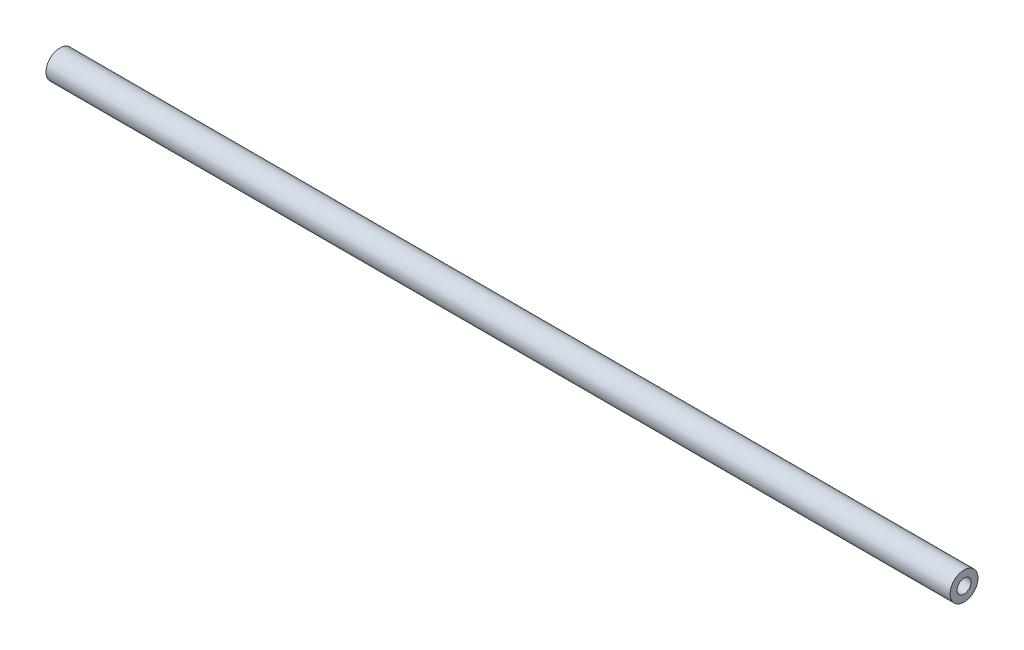
ISO-10303-21;
HEADER;
FILE_DESCRIPTION(('STEP AP214'),'2;1');
FILE_NAME('part.step','',(''),(''),'','','');
FILE_SCHEMA(('AUTOMOTIVE_DESIGN { 1 0 10303 214 1 1 1 1 }'));
ENDSEC;
DATA;
#1=APPLICATION_CONTEXT('core data for automotive mechanical design processes');
#2=APPLICATION_PROTOCOL_DEFINITION('international standard','automotive_design',2000,#1);
#3=PRODUCT_CONTEXT('',#1,'mechanical');
#4=PRODUCT('Part','Part','',(#3));
#5=PRODUCT_RELATED_PRODUCT_CATEGORY('part','',(#4));
#6=PRODUCT_DEFINITION_FORMATION('','',#4);
#7=PRODUCT_DEFINITION_CONTEXT('part definition',#1,'design');
#8=PRODUCT_DEFINITION('design','',#6,#7);
#9=PRODUCT_DEFINITION_SHAPE('','',#8);
#10=(LENGTH_UNIT() NAMED_UNIT(*) SI_UNIT(.MILLI.,.METRE.));
#11=(NAMED_UNIT(*) PLANE_ANGLE_UNIT() SI_UNIT($,.RADIAN.));
#12=(NAMED_UNIT(*) SI_UNIT($,.STERADIAN.) SOLID_ANGLE_UNIT());
#13=UNCERTAINTY_MEASURE_WITH_UNIT(LENGTH_MEASURE(1.E-05),#10,'distance_accuracy_value','');
#14=(GEOMETRIC_REPRESENTATION_CONTEXT(3) GLOBAL_UNCERTAINTY_ASSIGNED_CONTEXT((#13)) GLOBAL_UNIT_ASSIGNED_CONTEXT((#10,
#11,#12)) REPRESENTATION_CONTEXT('',''));
#15=CARTESIAN_POINT('',(0.,0.,0.));
#16=DIRECTION('',(0.,0.,1.));
#17=DIRECTION('',(1.,0.,0.));
#18=AXIS2_PLACEMENT_3D('',#15,#16,#17);
#19=CARTESIAN_POINT('',(247.539999999989,0.,0.));
#20=DIRECTION('',(1.,0.,0.));
#21=DIRECTION('',(0.,0.,-1.));
#22=AXIS2_PLACEMENT_3D('',#19,#20,#21);
#23=PLANE('',#22);
#24=CARTESIAN_POINT('',(247.539999999989,0.,0.));
#25=DIRECTION('',(1.,0.,0.));
#26=DIRECTION('',(0.,0.,-1.));
#27=AXIS2_PLACEMENT_3D('',#24,#25,#26);
#28=CIRCLE('',#27,4.);
#29=CARTESIAN_POINT('',(247.539999999989,0.,-4.));
#30=VERTEX_POINT('',#29);
#31=EDGE_CURVE('E10',#30,#30,#28,.T.);
#32=ORIENTED_EDGE('',*,*,#31,.T.);
#33=EDGE_LOOP('',(#32));
#34=FACE_BOUND('',#33,.T.);
#35=CARTESIAN_POINT('',(247.539999999989,0.,0.));
#36=DIRECTION('',(1.,0.,0.));
#37=DIRECTION('',(0.,0.,-1.));
#38=AXIS2_PLACEMENT_3D('',#35,#36,#37);
#39=CIRCLE('',#38,2.);
#40=CARTESIAN_POINT('',(247.539999999989,0.,-2.));
#41=VERTEX_POINT('',#40);
#42=EDGE_CURVE('E38',#41,#41,#39,.T.);
#43=ORIENTED_EDGE('',*,*,#42,.F.);
#44=EDGE_LOOP('',(#43));
#45=FACE_BOUND('',#44,.T.);
#46=ADVANCED_FACE('F31',(#34,#45),#23,.T.);
#47=CARTESIAN_POINT('',(247.539999999989,0.,0.));
#48=DIRECTION('',(-1.,0.,0.));
#49=DIRECTION('',(0.,0.,1.));
#50=AXIS2_PLACEMENT_3D('',#47,#48,#49);
#51=CYLINDRICAL_SURFACE('',#50,4.);
#52=ORIENTED_EDGE('',*,*,#31,.F.);
#53=EDGE_LOOP('',(#52));
#54=FACE_BOUND('',#53,.T.);
#55=CARTESIAN_POINT('',(-11.9999999999974,0.,0.));
#56=DIRECTION('',(1.,0.,0.));
#57=DIRECTION('',(0.,0.,-1.));
#58=AXIS2_PLACEMENT_3D('',#55,#56,#57);
#59=CIRCLE('',#58,4.);
#60=CARTESIAN_POINT('',(-11.9999999999974,0.,-4.));
#61=VERTEX_POINT('',#60);
#62=EDGE_CURVE('E42',#61,#61,#59,.T.);
#63=ORIENTED_EDGE('',*,*,#62,.T.);
#64=EDGE_LOOP('',(#63));
#65=FACE_BOUND('',#64,.T.);
#66=ADVANCED_FACE('F33',(#54,#65),#51,.T.);
#67=CARTESIAN_POINT('',(247.539999999989,0.,0.));
#68=DIRECTION('',(-1.,0.,0.));
#69=DIRECTION('',(0.,0.,1.));
#70=AXIS2_PLACEMENT_3D('',#67,#68,#69);
#71=CYLINDRICAL_SURFACE('',#70,2.);
#72=ORIENTED_EDGE('',*,*,#42,.T.);
#73=EDGE_LOOP('',(#72));
#74=FACE_BOUND('',#73,.T.);
#75=CARTESIAN_POINT('',(-11.9999999999974,0.,0.));
#76=DIRECTION('',(1.,0.,0.));
#77=DIRECTION('',(0.,0.,-1.));
#78=AXIS2_PLACEMENT_3D('',#75,#76,#77);
#79=CIRCLE('',#78,2.);
#80=CARTESIAN_POINT('',(-11.9999999999974,0.,-2.));
#81=VERTEX_POINT('',#80);
#82=EDGE_CURVE('E46',#81,#81,#79,.T.);
#83=ORIENTED_EDGE('',*,*,#82,.F.);
#84=EDGE_LOOP('',(#83));
#85=FACE_BOUND('',#84,.T.);
#86=ADVANCED_FACE('F55',(#74,#85),#71,.F.);
#87=CARTESIAN_POINT('',(-11.9999999999974,0.,0.));
#88=DIRECTION('',(1.,0.,0.));
#89=DIRECTION('',(0.,0.,-1.));
#90=AXIS2_PLACEMENT_3D('',#87,#88,#89);
#91=PLANE('',#90);
#92=ORIENTED_EDGE('',*,*,#82,.T.);
#93=EDGE_LOOP('',(#92));
#94=FACE_BOUND('',#93,.T.);
#95=ORIENTED_EDGE('',*,*,#62,.F.);
#96=EDGE_LOOP('',(#95));
#97=FACE_BOUND('',#96,.T.);
#98=ADVANCED_FACE('F52',(#94,#97),#91,.F.);
#99=CLOSED_SHELL('',(#46,#66,#86,#98));
#100=MANIFOLD_SOLID_BREP('B2',#99);
#101=ADVANCED_BREP_SHAPE_REPRESENTATION('',(#18,#100),#14);
#102=SHAPE_DEFINITION_REPRESENTATION(#9,#101);
ENDSEC;
END-ISO-10303-21;
